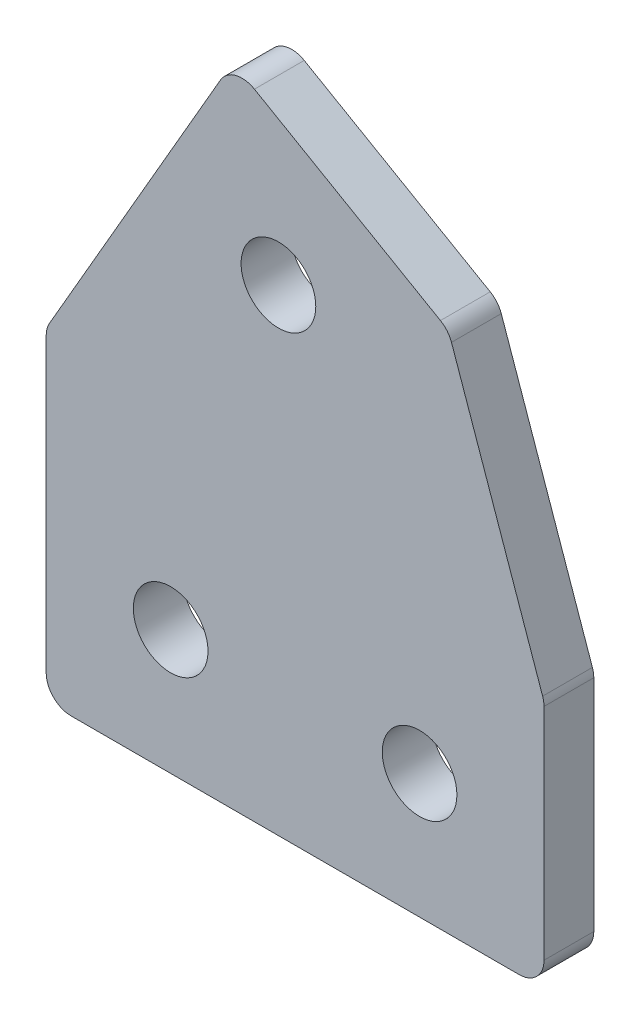
ISO-10303-21;
HEADER;
FILE_DESCRIPTION(('STEP AP214'),'2;1');
FILE_NAME('part.step','',(''),(''),'','','');
FILE_SCHEMA(('AUTOMOTIVE_DESIGN { 1 0 10303 214 1 1 1 1 }'));
ENDSEC;
DATA;
#1=APPLICATION_CONTEXT('core data for automotive mechanical design processes');
#2=APPLICATION_PROTOCOL_DEFINITION('international standard','automotive_design',2000,#1);
#3=PRODUCT_CONTEXT('',#1,'mechanical');
#4=PRODUCT('Part','Part','',(#3));
#5=PRODUCT_RELATED_PRODUCT_CATEGORY('part','',(#4));
#6=PRODUCT_DEFINITION_FORMATION('','',#4);
#7=PRODUCT_DEFINITION_CONTEXT('part definition',#1,'design');
#8=PRODUCT_DEFINITION('design','',#6,#7);
#9=PRODUCT_DEFINITION_SHAPE('','',#8);
#10=(LENGTH_UNIT() NAMED_UNIT(*) SI_UNIT(.MILLI.,.METRE.));
#11=(NAMED_UNIT(*) PLANE_ANGLE_UNIT() SI_UNIT($,.RADIAN.));
#12=(NAMED_UNIT(*) SI_UNIT($,.STERADIAN.) SOLID_ANGLE_UNIT());
#13=UNCERTAINTY_MEASURE_WITH_UNIT(LENGTH_MEASURE(1.E-05),#10,'distance_accuracy_value','');
#14=(GEOMETRIC_REPRESENTATION_CONTEXT(3) GLOBAL_UNCERTAINTY_ASSIGNED_CONTEXT((#13)) GLOBAL_UNIT_ASSIGNED_CONTEXT((#10,
#11,#12)) REPRESENTATION_CONTEXT('',''));
#15=CARTESIAN_POINT('',(0.,0.,0.));
#16=DIRECTION('',(0.,0.,1.));
#17=DIRECTION('',(1.,0.,0.));
#18=AXIS2_PLACEMENT_3D('',#15,#16,#17);
#19=CARTESIAN_POINT('',(0.,0.,2.));
#20=DIRECTION('',(0.,0.,-1.));
#21=DIRECTION('',(-1.,0.,0.));
#22=AXIS2_PLACEMENT_3D('',#19,#20,#21);
#23=PLANE('',#22);
#24=DIRECTION('',(-0.5,-0.866025403784438,0.));
#25=VECTOR('',#24,1.);
#26=CARTESIAN_POINT('',(-133.24064431535,-37.9842061544504,2.));
#27=LINE('',#26,#25);
#28=CARTESIAN_POINT('',(-126.24064431535,-25.8598505014682,2.));
#29=VERTEX_POINT('',#28);
#30=CARTESIAN_POINT('',(-133.106669719135,-37.7521553468815,2.));
#31=VERTEX_POINT('',#30);
#32=EDGE_CURVE('E234',#29,#31,#27,.T.);
#33=ORIENTED_EDGE('',*,*,#32,.T.);
#34=CARTESIAN_POINT('',(-132.24064431535,-38.2521553468815,2.));
#35=DIRECTION('',(0.,0.,-1.));
#36=DIRECTION('',(-1.,0.,0.));
#37=AXIS2_PLACEMENT_3D('',#34,#35,#36);
#38=CIRCLE('',#37,1.);
#39=CARTESIAN_POINT('',(-133.24064431535,-38.2521553468815,2.));
#40=VERTEX_POINT('',#39);
#41=EDGE_CURVE('E187',#31,#40,#38,.F.);
#42=ORIENTED_EDGE('',*,*,#41,.T.);
#43=DIRECTION('',(0.,-1.,0.));
#44=VECTOR('',#43,1.);
#45=CARTESIAN_POINT('',(-133.24064431535,-50.9842061544504,2.));
#46=LINE('',#45,#44);
#47=CARTESIAN_POINT('',(-133.24064431535,-49.9842061544505,2.));
#48=VERTEX_POINT('',#47);
#49=EDGE_CURVE('E149',#40,#48,#46,.T.);
#50=ORIENTED_EDGE('',*,*,#49,.T.);
#51=CARTESIAN_POINT('',(-132.24064431535,-49.9842061544505,2.));
#52=DIRECTION('',(0.,0.,-1.));
#53=DIRECTION('',(-1.,0.,0.));
#54=AXIS2_PLACEMENT_3D('',#51,#52,#53);
#55=CIRCLE('',#54,1.);
#56=CARTESIAN_POINT('',(-132.24064431535,-50.9842061544504,2.));
#57=VERTEX_POINT('',#56);
#58=EDGE_CURVE('E185',#48,#57,#55,.F.);
#59=ORIENTED_EDGE('',*,*,#58,.T.);
#60=DIRECTION('',(1.,0.,0.));
#61=VECTOR('',#60,1.);
#62=CARTESIAN_POINT('',(-123.24064431535,-50.9842061544504,2.));
#63=LINE('',#62,#61);
#64=CARTESIAN_POINT('',(-114.24064431535,-50.9842061544504,2.));
#65=VERTEX_POINT('',#64);
#66=EDGE_CURVE('E156',#57,#65,#63,.T.);
#67=ORIENTED_EDGE('',*,*,#66,.T.);
#68=CARTESIAN_POINT('',(-114.24064431535,-49.9842061544504,2.));
#69=DIRECTION('',(0.,0.,-1.));
#70=DIRECTION('',(-1.,0.,0.));
#71=AXIS2_PLACEMENT_3D('',#68,#69,#70);
#72=CIRCLE('',#71,1.);
#73=CARTESIAN_POINT('',(-113.24064431535,-49.9842061544504,2.));
#74=VERTEX_POINT('',#73);
#75=EDGE_CURVE('E178',#65,#74,#72,.F.);
#76=ORIENTED_EDGE('',*,*,#75,.T.);
#77=DIRECTION('',(0.,1.,0.));
#78=VECTOR('',#77,1.);
#79=CARTESIAN_POINT('',(-113.24064431535,-50.9842061544504,2.));
#80=LINE('',#79,#78);
#81=CARTESIAN_POINT('',(-113.24064431535,-41.1538646355493,2.));
#82=VERTEX_POINT('',#81);
#83=EDGE_CURVE('E160',#74,#82,#80,.T.);
#84=ORIENTED_EDGE('',*,*,#83,.T.);
#85=CARTESIAN_POINT('',(-114.24064431535,-41.1538646355493,2.));
#86=DIRECTION('',(0.,0.,-1.));
#87=DIRECTION('',(-1.,0.,0.));
#88=AXIS2_PLACEMENT_3D('',#85,#86,#87);
#89=CIRCLE('',#88,1.);
#90=CARTESIAN_POINT('',(-113.29660164012,-40.8240413080783,2.));
#91=VERTEX_POINT('',#90);
#92=EDGE_CURVE('E180',#82,#91,#89,.F.);
#93=ORIENTED_EDGE('',*,*,#92,.T.);
#94=DIRECTION('',(-0.329823327471087,0.944042675230257,0.));
#95=VECTOR('',#94,1.);
#96=CARTESIAN_POINT('',(-113.24064431535,-40.9842061544504,2.));
#97=LINE('',#96,#95);
#98=CARTESIAN_POINT('',(-116.957920245255,-30.3443671220088,2.));
#99=VERTEX_POINT('',#98);
#100=EDGE_CURVE('E239',#91,#99,#97,.T.);
#101=ORIENTED_EDGE('',*,*,#100,.T.);
#102=CARTESIAN_POINT('',(-117.901962920486,-30.6741904494798,2.));
#103=DIRECTION('',(0.,0.,-1.));
#104=DIRECTION('',(-1.,0.,0.));
#105=AXIS2_PLACEMENT_3D('',#102,#103,#104);
#106=CIRCLE('',#105,1.);
#107=CARTESIAN_POINT('',(-117.401962920486,-29.8081650456954,2.));
#108=VERTEX_POINT('',#107);
#109=EDGE_CURVE('E61',#99,#108,#106,.F.);
#110=ORIENTED_EDGE('',*,*,#109,.T.);
#111=DIRECTION('',(-0.866025403784439,0.5,0.));
#112=VECTOR('',#111,1.);
#113=CARTESIAN_POINT('',(-125.74064431535,-24.9938250976838,2.));
#114=LINE('',#113,#112);
#115=CARTESIAN_POINT('',(-124.874618911566,-25.4938250976838,2.));
#116=VERTEX_POINT('',#115);
#117=EDGE_CURVE('E235',#108,#116,#114,.T.);
#118=ORIENTED_EDGE('',*,*,#117,.T.);
#119=CARTESIAN_POINT('',(-125.374618911566,-26.3598505014682,2.));
#120=DIRECTION('',(0.,0.,-1.));
#121=DIRECTION('',(-1.,0.,0.));
#122=AXIS2_PLACEMENT_3D('',#119,#120,#121);
#123=CIRCLE('',#122,1.);
#124=EDGE_CURVE('E183',#116,#29,#123,.F.);
#125=ORIENTED_EDGE('',*,*,#124,.T.);
#126=EDGE_LOOP('',(#33,#42,#50,#59,#67,#76,#84,#93,#101,#110,#118,#125));
#127=FACE_BOUND('',#126,.T.);
#128=CARTESIAN_POINT('',(-128.24064431535,-45.9842061544505,2.));
#129=DIRECTION('',(0.,0.,1.));
#130=DIRECTION('',(1.,0.,0.));
#131=AXIS2_PLACEMENT_3D('',#128,#129,#130);
#132=CIRCLE('',#131,1.5);
#133=CARTESIAN_POINT('',(-126.74064431535,-45.9842061544505,2.));
#134=VERTEX_POINT('',#133);
#135=EDGE_CURVE('E221',#134,#134,#132,.T.);
#136=ORIENTED_EDGE('',*,*,#135,.F.);
#137=EDGE_LOOP('',(#136));
#138=FACE_BOUND('',#137,.T.);
#139=CARTESIAN_POINT('',(-123.910517296428,-31.823952116606,2.));
#140=DIRECTION('',(0.,0.,1.));
#141=DIRECTION('',(1.,0.,0.));
#142=AXIS2_PLACEMENT_3D('',#139,#140,#141);
#143=CIRCLE('',#142,1.49999999999998);
#144=CARTESIAN_POINT('',(-122.410517296428,-31.823952116606,2.));
#145=VERTEX_POINT('',#144);
#146=EDGE_CURVE('E247',#145,#145,#143,.T.);
#147=ORIENTED_EDGE('',*,*,#146,.F.);
#148=EDGE_LOOP('',(#147));
#149=FACE_BOUND('',#148,.T.);
#150=CARTESIAN_POINT('',(-118.24064431535,-45.9842061544504,2.));
#151=DIRECTION('',(0.,0.,1.));
#152=DIRECTION('',(1.,0.,0.));
#153=AXIS2_PLACEMENT_3D('',#150,#151,#152);
#154=CIRCLE('',#153,1.5);
#155=CARTESIAN_POINT('',(-116.74064431535,-45.9842061544504,2.));
#156=VERTEX_POINT('',#155);
#157=EDGE_CURVE('E253',#156,#156,#154,.T.);
#158=ORIENTED_EDGE('',*,*,#157,.F.);
#159=EDGE_LOOP('',(#158));
#160=FACE_BOUND('',#159,.T.);
#161=ADVANCED_FACE('F39',(#127,#138,#149,#160),#23,.F.);
#162=CARTESIAN_POINT('',(0.,0.,0.));
#163=DIRECTION('',(0.,0.,-1.));
#164=DIRECTION('',(-1.,0.,0.));
#165=AXIS2_PLACEMENT_3D('',#162,#163,#164);
#166=PLANE('',#165);
#167=CARTESIAN_POINT('',(-123.910517296428,-31.823952116606,0.));
#168=DIRECTION('',(0.,0.,1.));
#169=DIRECTION('',(1.,0.,0.));
#170=AXIS2_PLACEMENT_3D('',#167,#168,#169);
#171=CIRCLE('',#170,1.49999999999998);
#172=CARTESIAN_POINT('',(-122.410517296428,-31.823952116606,0.));
#173=VERTEX_POINT('',#172);
#174=EDGE_CURVE('E250',#173,#173,#171,.T.);
#175=ORIENTED_EDGE('',*,*,#174,.T.);
#176=EDGE_LOOP('',(#175));
#177=FACE_BOUND('',#176,.T.);
#178=DIRECTION('',(0.,-1.,0.));
#179=VECTOR('',#178,1.);
#180=CARTESIAN_POINT('',(-133.24064431535,-50.9842061544504,0.));
#181=LINE('',#180,#179);
#182=CARTESIAN_POINT('',(-133.24064431535,-38.2521553468815,0.));
#183=VERTEX_POINT('',#182);
#184=CARTESIAN_POINT('',(-133.24064431535,-49.9842061544505,0.));
#185=VERTEX_POINT('',#184);
#186=EDGE_CURVE('E146',#183,#185,#181,.T.);
#187=ORIENTED_EDGE('',*,*,#186,.F.);
#188=CARTESIAN_POINT('',(-132.24064431535,-38.2521553468815,0.));
#189=DIRECTION('',(0.,0.,-1.));
#190=DIRECTION('',(-1.,0.,0.));
#191=AXIS2_PLACEMENT_3D('',#188,#189,#190);
#192=CIRCLE('',#191,1.);
#193=CARTESIAN_POINT('',(-133.106669719135,-37.7521553468815,0.));
#194=VERTEX_POINT('',#193);
#195=EDGE_CURVE('E129',#183,#194,#192,.T.);
#196=ORIENTED_EDGE('',*,*,#195,.T.);
#197=DIRECTION('',(-0.5,-0.866025403784438,0.));
#198=VECTOR('',#197,1.);
#199=CARTESIAN_POINT('',(-133.24064431535,-37.9842061544504,0.));
#200=LINE('',#199,#198);
#201=CARTESIAN_POINT('',(-126.24064431535,-25.8598505014682,0.));
#202=VERTEX_POINT('',#201);
#203=EDGE_CURVE('E157',#202,#194,#200,.T.);
#204=ORIENTED_EDGE('',*,*,#203,.F.);
#205=CARTESIAN_POINT('',(-125.374618911566,-26.3598505014682,0.));
#206=DIRECTION('',(0.,0.,-1.));
#207=DIRECTION('',(-1.,0.,0.));
#208=AXIS2_PLACEMENT_3D('',#205,#206,#207);
#209=CIRCLE('',#208,1.);
#210=CARTESIAN_POINT('',(-124.874618911566,-25.4938250976838,0.));
#211=VERTEX_POINT('',#210);
#212=EDGE_CURVE('E172',#202,#211,#209,.T.);
#213=ORIENTED_EDGE('',*,*,#212,.T.);
#214=DIRECTION('',(-0.866025403784439,0.5,0.));
#215=VECTOR('',#214,1.);
#216=CARTESIAN_POINT('',(-125.74064431535,-24.9938250976838,0.));
#217=LINE('',#216,#215);
#218=CARTESIAN_POINT('',(-117.401962920486,-29.8081650456954,0.));
#219=VERTEX_POINT('',#218);
#220=EDGE_CURVE('E162',#219,#211,#217,.T.);
#221=ORIENTED_EDGE('',*,*,#220,.F.);
#222=CARTESIAN_POINT('',(-117.901962920486,-30.6741904494798,0.));
#223=DIRECTION('',(0.,0.,-1.));
#224=DIRECTION('',(-1.,0.,0.));
#225=AXIS2_PLACEMENT_3D('',#222,#223,#224);
#226=CIRCLE('',#225,1.);
#227=CARTESIAN_POINT('',(-116.957920245255,-30.3443671220088,0.));
#228=VERTEX_POINT('',#227);
#229=EDGE_CURVE('E170',#219,#228,#226,.T.);
#230=ORIENTED_EDGE('',*,*,#229,.T.);
#231=DIRECTION('',(-0.329823327471087,0.944042675230257,0.));
#232=VECTOR('',#231,1.);
#233=CARTESIAN_POINT('',(-113.24064431535,-40.9842061544504,0.));
#234=LINE('',#233,#232);
#235=CARTESIAN_POINT('',(-113.29660164012,-40.8240413080783,0.));
#236=VERTEX_POINT('',#235);
#237=EDGE_CURVE('E216',#236,#228,#234,.T.);
#238=ORIENTED_EDGE('',*,*,#237,.F.);
#239=CARTESIAN_POINT('',(-114.24064431535,-41.1538646355493,0.));
#240=DIRECTION('',(0.,0.,-1.));
#241=DIRECTION('',(-1.,0.,0.));
#242=AXIS2_PLACEMENT_3D('',#239,#240,#241);
#243=CIRCLE('',#242,1.);
#244=CARTESIAN_POINT('',(-113.24064431535,-41.1538646355493,0.));
#245=VERTEX_POINT('',#244);
#246=EDGE_CURVE('E168',#236,#245,#243,.T.);
#247=ORIENTED_EDGE('',*,*,#246,.T.);
#248=DIRECTION('',(0.,1.,0.));
#249=VECTOR('',#248,1.);
#250=CARTESIAN_POINT('',(-113.24064431535,-50.9842061544504,0.));
#251=LINE('',#250,#249);
#252=CARTESIAN_POINT('',(-113.24064431535,-49.9842061544504,0.));
#253=VERTEX_POINT('',#252);
#254=EDGE_CURVE('E209',#253,#245,#251,.T.);
#255=ORIENTED_EDGE('',*,*,#254,.F.);
#256=CARTESIAN_POINT('',(-114.24064431535,-49.9842061544504,0.));
#257=DIRECTION('',(0.,0.,-1.));
#258=DIRECTION('',(-1.,0.,0.));
#259=AXIS2_PLACEMENT_3D('',#256,#257,#258);
#260=CIRCLE('',#259,1.);
#261=CARTESIAN_POINT('',(-114.24064431535,-50.9842061544504,0.));
#262=VERTEX_POINT('',#261);
#263=EDGE_CURVE('E150',#253,#262,#260,.T.);
#264=ORIENTED_EDGE('',*,*,#263,.T.);
#265=DIRECTION('',(1.,0.,0.));
#266=VECTOR('',#265,1.);
#267=CARTESIAN_POINT('',(-123.24064431535,-50.9842061544504,0.));
#268=LINE('',#267,#266);
#269=CARTESIAN_POINT('',(-132.24064431535,-50.9842061544505,0.));
#270=VERTEX_POINT('',#269);
#271=EDGE_CURVE('E217',#270,#262,#268,.T.);
#272=ORIENTED_EDGE('',*,*,#271,.F.);
#273=CARTESIAN_POINT('',(-132.24064431535,-49.9842061544505,0.));
#274=DIRECTION('',(0.,0.,-1.));
#275=DIRECTION('',(-1.,0.,0.));
#276=AXIS2_PLACEMENT_3D('',#273,#274,#275);
#277=CIRCLE('',#276,1.);
#278=EDGE_CURVE('E140',#270,#185,#277,.T.);
#279=ORIENTED_EDGE('',*,*,#278,.T.);
#280=EDGE_LOOP('',(#187,#196,#204,#213,#221,#230,#238,#247,#255,#264,#272,#279));
#281=FACE_BOUND('',#280,.T.);
#282=CARTESIAN_POINT('',(-128.24064431535,-45.9842061544505,0.));
#283=DIRECTION('',(0.,0.,1.));
#284=DIRECTION('',(1.,0.,0.));
#285=AXIS2_PLACEMENT_3D('',#282,#283,#284);
#286=CIRCLE('',#285,1.5);
#287=CARTESIAN_POINT('',(-126.74064431535,-45.9842061544505,0.));
#288=VERTEX_POINT('',#287);
#289=EDGE_CURVE('E244',#288,#288,#286,.T.);
#290=ORIENTED_EDGE('',*,*,#289,.T.);
#291=EDGE_LOOP('',(#290));
#292=FACE_BOUND('',#291,.T.);
#293=CARTESIAN_POINT('',(-118.24064431535,-45.9842061544504,0.));
#294=DIRECTION('',(0.,0.,1.));
#295=DIRECTION('',(1.,0.,0.));
#296=AXIS2_PLACEMENT_3D('',#293,#294,#295);
#297=CIRCLE('',#296,1.5);
#298=CARTESIAN_POINT('',(-116.74064431535,-45.9842061544504,0.));
#299=VERTEX_POINT('',#298);
#300=EDGE_CURVE('E256',#299,#299,#297,.T.);
#301=ORIENTED_EDGE('',*,*,#300,.T.);
#302=EDGE_LOOP('',(#301));
#303=FACE_BOUND('',#302,.T.);
#304=ADVANCED_FACE('F153',(#177,#281,#292,#303),#166,.T.);
#305=CARTESIAN_POINT('',(-123.24064431535,-50.9842061544504,2.));
#306=DIRECTION('',(0.,1.,0.));
#307=DIRECTION('',(-1.,0.,0.));
#308=AXIS2_PLACEMENT_3D('',#305,#306,#307);
#309=PLANE('',#308);
#310=ORIENTED_EDGE('',*,*,#66,.F.);
#311=DIRECTION('',(0.,0.,-1.));
#312=VECTOR('',#311,1.);
#313=CARTESIAN_POINT('',(-132.24064431535,-50.9842061544505,2.));
#314=LINE('',#313,#312);
#315=EDGE_CURVE('E191',#57,#270,#314,.T.);
#316=ORIENTED_EDGE('',*,*,#315,.T.);
#317=ORIENTED_EDGE('',*,*,#271,.T.);
#318=DIRECTION('',(0.,0.,-1.));
#319=VECTOR('',#318,1.);
#320=CARTESIAN_POINT('',(-114.24064431535,-50.9842061544504,2.));
#321=LINE('',#320,#319);
#322=EDGE_CURVE('E189',#262,#65,#321,.F.);
#323=ORIENTED_EDGE('',*,*,#322,.T.);
#324=EDGE_LOOP('',(#310,#316,#317,#323));
#325=FACE_BOUND('',#324,.T.);
#326=ADVANCED_FACE('F270',(#325),#309,.F.);
#327=CARTESIAN_POINT('',(-113.24064431535,-50.9842061544504,2.));
#328=DIRECTION('',(-1.,0.,0.));
#329=DIRECTION('',(0.,-1.,0.));
#330=AXIS2_PLACEMENT_3D('',#327,#328,#329);
#331=PLANE('',#330);
#332=ORIENTED_EDGE('',*,*,#254,.T.);
#333=DIRECTION('',(0.,0.,-1.));
#334=VECTOR('',#333,1.);
#335=CARTESIAN_POINT('',(-113.24064431535,-41.1538646355493,2.));
#336=LINE('',#335,#334);
#337=EDGE_CURVE('E11',#245,#82,#336,.F.);
#338=ORIENTED_EDGE('',*,*,#337,.T.);
#339=ORIENTED_EDGE('',*,*,#83,.F.);
#340=DIRECTION('',(0.,0.,-1.));
#341=VECTOR('',#340,1.);
#342=CARTESIAN_POINT('',(-113.24064431535,-49.9842061544504,2.));
#343=LINE('',#342,#341);
#344=EDGE_CURVE('E47',#74,#253,#343,.T.);
#345=ORIENTED_EDGE('',*,*,#344,.T.);
#346=EDGE_LOOP('',(#332,#338,#339,#345));
#347=FACE_BOUND('',#346,.T.);
#348=ADVANCED_FACE('F208',(#347),#331,.F.);
#349=CARTESIAN_POINT('',(-113.24064431535,-40.9842061544504,2.));
#350=DIRECTION('',(-0.944042675230257,-0.329823327471087,0.));
#351=DIRECTION('',(0.329823327471087,-0.944042675230257,0.));
#352=AXIS2_PLACEMENT_3D('',#349,#350,#351);
#353=PLANE('',#352);
#354=ORIENTED_EDGE('',*,*,#237,.T.);
#355=DIRECTION('',(0.,0.,-1.));
#356=VECTOR('',#355,1.);
#357=CARTESIAN_POINT('',(-116.957920245255,-30.3443671220088,2.));
#358=LINE('',#357,#356);
#359=EDGE_CURVE('E201',#228,#99,#358,.F.);
#360=ORIENTED_EDGE('',*,*,#359,.T.);
#361=ORIENTED_EDGE('',*,*,#100,.F.);
#362=DIRECTION('',(0.,0.,-1.));
#363=VECTOR('',#362,1.);
#364=CARTESIAN_POINT('',(-113.29660164012,-40.8240413080783,2.));
#365=LINE('',#364,#363);
#366=EDGE_CURVE('E198',#91,#236,#365,.T.);
#367=ORIENTED_EDGE('',*,*,#366,.T.);
#368=EDGE_LOOP('',(#354,#360,#361,#367));
#369=FACE_BOUND('',#368,.T.);
#370=ADVANCED_FACE('F283',(#369),#353,.F.);
#371=CARTESIAN_POINT('',(-125.74064431535,-24.9938250976838,2.));
#372=DIRECTION('',(-0.5,-0.866025403784439,0.));
#373=DIRECTION('',(0.866025403784439,-0.5,0.));
#374=AXIS2_PLACEMENT_3D('',#371,#372,#373);
#375=PLANE('',#374);
#376=ORIENTED_EDGE('',*,*,#220,.T.);
#377=DIRECTION('',(0.,0.,-1.));
#378=VECTOR('',#377,1.);
#379=CARTESIAN_POINT('',(-124.874618911566,-25.4938250976838,2.));
#380=LINE('',#379,#378);
#381=EDGE_CURVE('E54',#211,#116,#380,.F.);
#382=ORIENTED_EDGE('',*,*,#381,.T.);
#383=ORIENTED_EDGE('',*,*,#117,.F.);
#384=DIRECTION('',(0.,0.,-1.));
#385=VECTOR('',#384,1.);
#386=CARTESIAN_POINT('',(-117.401962920486,-29.8081650456954,2.));
#387=LINE('',#386,#385);
#388=EDGE_CURVE('E194',#108,#219,#387,.T.);
#389=ORIENTED_EDGE('',*,*,#388,.T.);
#390=EDGE_LOOP('',(#376,#382,#383,#389));
#391=FACE_BOUND('',#390,.T.);
#392=ADVANCED_FACE('F225',(#391),#375,.F.);
#393=CARTESIAN_POINT('',(-133.24064431535,-37.9842061544504,2.));
#394=DIRECTION('',(0.866025403784438,-0.5,0.));
#395=DIRECTION('',(0.5,0.866025403784438,0.));
#396=AXIS2_PLACEMENT_3D('',#393,#394,#395);
#397=PLANE('',#396);
#398=ORIENTED_EDGE('',*,*,#203,.T.);
#399=DIRECTION('',(0.,0.,-1.));
#400=VECTOR('',#399,1.);
#401=CARTESIAN_POINT('',(-133.106669719135,-37.7521553468815,2.));
#402=LINE('',#401,#400);
#403=EDGE_CURVE('E134',#194,#31,#402,.F.);
#404=ORIENTED_EDGE('',*,*,#403,.T.);
#405=ORIENTED_EDGE('',*,*,#32,.F.);
#406=DIRECTION('',(0.,0.,-1.));
#407=VECTOR('',#406,1.);
#408=CARTESIAN_POINT('',(-126.24064431535,-25.8598505014682,2.));
#409=LINE('',#408,#407);
#410=EDGE_CURVE('E139',#29,#202,#409,.T.);
#411=ORIENTED_EDGE('',*,*,#410,.T.);
#412=EDGE_LOOP('',(#398,#404,#405,#411));
#413=FACE_BOUND('',#412,.T.);
#414=ADVANCED_FACE('F237',(#413),#397,.F.);
#415=CARTESIAN_POINT('',(-133.24064431535,-50.9842061544504,2.));
#416=DIRECTION('',(1.,0.,0.));
#417=DIRECTION('',(0.,0.,-1.));
#418=AXIS2_PLACEMENT_3D('',#415,#416,#417);
#419=PLANE('',#418);
#420=ORIENTED_EDGE('',*,*,#49,.F.);
#421=DIRECTION('',(0.,0.,-1.));
#422=VECTOR('',#421,1.);
#423=CARTESIAN_POINT('',(-133.24064431535,-38.2521553468815,2.));
#424=LINE('',#423,#422);
#425=EDGE_CURVE('E133',#40,#183,#424,.T.);
#426=ORIENTED_EDGE('',*,*,#425,.T.);
#427=ORIENTED_EDGE('',*,*,#186,.T.);
#428=DIRECTION('',(0.,0.,-1.));
#429=VECTOR('',#428,1.);
#430=CARTESIAN_POINT('',(-133.24064431535,-49.9842061544505,2.));
#431=LINE('',#430,#429);
#432=EDGE_CURVE('E151',#185,#48,#431,.F.);
#433=ORIENTED_EDGE('',*,*,#432,.T.);
#434=EDGE_LOOP('',(#420,#426,#427,#433));
#435=FACE_BOUND('',#434,.T.);
#436=ADVANCED_FACE('F145',(#435),#419,.F.);
#437=CARTESIAN_POINT('',(-128.24064431535,-45.9842061544505,2.));
#438=DIRECTION('',(0.,0.,-1.));
#439=DIRECTION('',(-1.,0.,0.));
#440=AXIS2_PLACEMENT_3D('',#437,#438,#439);
#441=CYLINDRICAL_SURFACE('',#440,1.5);
#442=ORIENTED_EDGE('',*,*,#135,.T.);
#443=EDGE_LOOP('',(#442));
#444=FACE_BOUND('',#443,.T.);
#445=ORIENTED_EDGE('',*,*,#289,.F.);
#446=EDGE_LOOP('',(#445));
#447=FACE_BOUND('',#446,.T.);
#448=ADVANCED_FACE('F274',(#444,#447),#441,.F.);
#449=CARTESIAN_POINT('',(-123.910517296428,-31.823952116606,2.));
#450=DIRECTION('',(0.,0.,-1.));
#451=DIRECTION('',(-1.,0.,0.));
#452=AXIS2_PLACEMENT_3D('',#449,#450,#451);
#453=CYLINDRICAL_SURFACE('',#452,1.49999999999998);
#454=ORIENTED_EDGE('',*,*,#146,.T.);
#455=EDGE_LOOP('',(#454));
#456=FACE_BOUND('',#455,.T.);
#457=ORIENTED_EDGE('',*,*,#174,.F.);
#458=EDGE_LOOP('',(#457));
#459=FACE_BOUND('',#458,.T.);
#460=ADVANCED_FACE('F418',(#456,#459),#453,.F.);
#461=CARTESIAN_POINT('',(-118.24064431535,-45.9842061544504,2.));
#462=DIRECTION('',(0.,0.,-1.));
#463=DIRECTION('',(-1.,0.,0.));
#464=AXIS2_PLACEMENT_3D('',#461,#462,#463);
#465=CYLINDRICAL_SURFACE('',#464,1.5);
#466=ORIENTED_EDGE('',*,*,#157,.T.);
#467=EDGE_LOOP('',(#466));
#468=FACE_BOUND('',#467,.T.);
#469=ORIENTED_EDGE('',*,*,#300,.F.);
#470=EDGE_LOOP('',(#469));
#471=FACE_BOUND('',#470,.T.);
#472=ADVANCED_FACE('F262',(#468,#471),#465,.F.);
#473=CARTESIAN_POINT('',(-132.24064431535,-38.2521553468815,2.));
#474=DIRECTION('',(0.,0.,-1.));
#475=DIRECTION('',(-1.,0.,0.));
#476=AXIS2_PLACEMENT_3D('',#473,#474,#475);
#477=CYLINDRICAL_SURFACE('',#476,1.);
#478=ORIENTED_EDGE('',*,*,#41,.F.);
#479=ORIENTED_EDGE('',*,*,#403,.F.);
#480=ORIENTED_EDGE('',*,*,#195,.F.);
#481=ORIENTED_EDGE('',*,*,#425,.F.);
#482=EDGE_LOOP('',(#478,#479,#480,#481));
#483=FACE_BOUND('',#482,.T.);
#484=ADVANCED_FACE('F132',(#483),#477,.T.);
#485=CARTESIAN_POINT('',(-132.24064431535,-49.9842061544505,2.));
#486=DIRECTION('',(0.,0.,-1.));
#487=DIRECTION('',(-1.,0.,0.));
#488=AXIS2_PLACEMENT_3D('',#485,#486,#487);
#489=CYLINDRICAL_SURFACE('',#488,1.);
#490=ORIENTED_EDGE('',*,*,#58,.F.);
#491=ORIENTED_EDGE('',*,*,#432,.F.);
#492=ORIENTED_EDGE('',*,*,#278,.F.);
#493=ORIENTED_EDGE('',*,*,#315,.F.);
#494=EDGE_LOOP('',(#490,#491,#492,#493));
#495=FACE_BOUND('',#494,.T.);
#496=ADVANCED_FACE('F294',(#495),#489,.T.);
#497=CARTESIAN_POINT('',(-125.374618911566,-26.3598505014682,2.));
#498=DIRECTION('',(0.,0.,-1.));
#499=DIRECTION('',(-1.,0.,0.));
#500=AXIS2_PLACEMENT_3D('',#497,#498,#499);
#501=CYLINDRICAL_SURFACE('',#500,1.);
#502=ORIENTED_EDGE('',*,*,#124,.F.);
#503=ORIENTED_EDGE('',*,*,#381,.F.);
#504=ORIENTED_EDGE('',*,*,#212,.F.);
#505=ORIENTED_EDGE('',*,*,#410,.F.);
#506=EDGE_LOOP('',(#502,#503,#504,#505));
#507=FACE_BOUND('',#506,.T.);
#508=ADVANCED_FACE('F229',(#507),#501,.T.);
#509=CARTESIAN_POINT('',(-117.901962920486,-30.6741904494798,2.));
#510=DIRECTION('',(0.,0.,-1.));
#511=DIRECTION('',(-1.,0.,0.));
#512=AXIS2_PLACEMENT_3D('',#509,#510,#511);
#513=CYLINDRICAL_SURFACE('',#512,1.);
#514=ORIENTED_EDGE('',*,*,#109,.F.);
#515=ORIENTED_EDGE('',*,*,#359,.F.);
#516=ORIENTED_EDGE('',*,*,#229,.F.);
#517=ORIENTED_EDGE('',*,*,#388,.F.);
#518=EDGE_LOOP('',(#514,#515,#516,#517));
#519=FACE_BOUND('',#518,.T.);
#520=ADVANCED_FACE('F300',(#519),#513,.T.);
#521=CARTESIAN_POINT('',(-114.24064431535,-41.1538646355493,2.));
#522=DIRECTION('',(0.,0.,-1.));
#523=DIRECTION('',(-1.,0.,0.));
#524=AXIS2_PLACEMENT_3D('',#521,#522,#523);
#525=CYLINDRICAL_SURFACE('',#524,1.);
#526=ORIENTED_EDGE('',*,*,#92,.F.);
#527=ORIENTED_EDGE('',*,*,#337,.F.);
#528=ORIENTED_EDGE('',*,*,#246,.F.);
#529=ORIENTED_EDGE('',*,*,#366,.F.);
#530=EDGE_LOOP('',(#526,#527,#528,#529));
#531=FACE_BOUND('',#530,.T.);
#532=ADVANCED_FACE('F302',(#531),#525,.T.);
#533=CARTESIAN_POINT('',(-114.24064431535,-49.9842061544504,2.));
#534=DIRECTION('',(0.,0.,-1.));
#535=DIRECTION('',(-1.,0.,0.));
#536=AXIS2_PLACEMENT_3D('',#533,#534,#535);
#537=CYLINDRICAL_SURFACE('',#536,1.);
#538=ORIENTED_EDGE('',*,*,#75,.F.);
#539=ORIENTED_EDGE('',*,*,#322,.F.);
#540=ORIENTED_EDGE('',*,*,#263,.F.);
#541=ORIENTED_EDGE('',*,*,#344,.F.);
#542=EDGE_LOOP('',(#538,#539,#540,#541));
#543=FACE_BOUND('',#542,.T.);
#544=ADVANCED_FACE('F41',(#543),#537,.T.);
#545=CLOSED_SHELL('',(#161,#304,#326,#348,#370,#392,#414,#436,#448,#460,#472,#484,#496,#508,
#520,#532,#544));
#546=MANIFOLD_SOLID_BREP('B2',#545);
#547=ADVANCED_BREP_SHAPE_REPRESENTATION('',(#18,#546),#14);
#548=SHAPE_DEFINITION_REPRESENTATION(#9,#547);
ENDSEC;
END-ISO-10303-21;
